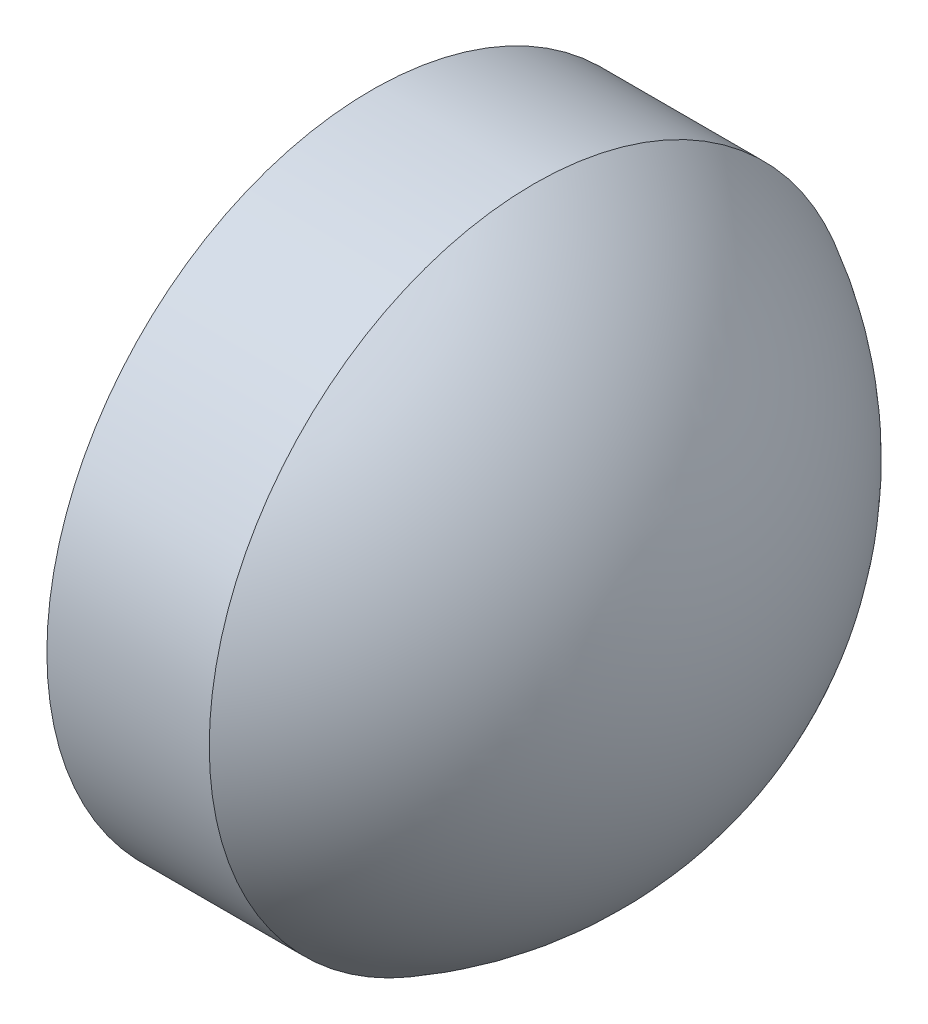
ISO-10303-21;
HEADER;
FILE_DESCRIPTION(('STEP AP214'),'2;1');
FILE_NAME('part.step','',(''),(''),'','','');
FILE_SCHEMA(('AUTOMOTIVE_DESIGN { 1 0 10303 214 1 1 1 1 }'));
ENDSEC;
DATA;
#1=APPLICATION_CONTEXT('core data for automotive mechanical design processes');
#2=APPLICATION_PROTOCOL_DEFINITION('international standard','automotive_design',2000,#1);
#3=PRODUCT_CONTEXT('',#1,'mechanical');
#4=PRODUCT('Part','Part','',(#3));
#5=PRODUCT_RELATED_PRODUCT_CATEGORY('part','',(#4));
#6=PRODUCT_DEFINITION_FORMATION('','',#4);
#7=PRODUCT_DEFINITION_CONTEXT('part definition',#1,'design');
#8=PRODUCT_DEFINITION('design','',#6,#7);
#9=PRODUCT_DEFINITION_SHAPE('','',#8);
#10=(LENGTH_UNIT() NAMED_UNIT(*) SI_UNIT(.MILLI.,.METRE.));
#11=(NAMED_UNIT(*) PLANE_ANGLE_UNIT() SI_UNIT($,.RADIAN.));
#12=(NAMED_UNIT(*) SI_UNIT($,.STERADIAN.) SOLID_ANGLE_UNIT());
#13=UNCERTAINTY_MEASURE_WITH_UNIT(LENGTH_MEASURE(1.E-05),#10,'distance_accuracy_value','');
#14=(GEOMETRIC_REPRESENTATION_CONTEXT(3) GLOBAL_UNCERTAINTY_ASSIGNED_CONTEXT((#13)) GLOBAL_UNIT_ASSIGNED_CONTEXT((#10,
#11,#12)) REPRESENTATION_CONTEXT('',''));
#15=CARTESIAN_POINT('',(0.,0.,0.));
#16=DIRECTION('',(0.,0.,1.));
#17=DIRECTION('',(1.,0.,0.));
#18=AXIS2_PLACEMENT_3D('',#15,#16,#17);
#19=CARTESIAN_POINT('',(360.225864803302,32.4014421281485,0.));
#20=DIRECTION('',(-1.,0.,0.));
#21=DIRECTION('',(0.,1.,0.));
#22=AXIS2_PLACEMENT_3D('',#19,#20,#21);
#23=SPHERICAL_SURFACE('',#22,2.26666666666669);
#24=CARTESIAN_POINT('',(361.292531469969,32.4014421281485,0.));
#25=DIRECTION('',(-1.,0.,0.));
#26=DIRECTION('',(0.,0.,1.));
#27=AXIS2_PLACEMENT_3D('',#24,#25,#26);
#28=CIRCLE('',#27,2.);
#29=CARTESIAN_POINT('',(361.292531469969,32.4014421281485,2.));
#30=VERTEX_POINT('',#29);
#31=EDGE_CURVE('E10',#30,#30,#28,.T.);
#32=ORIENTED_EDGE('',*,*,#31,.F.);
#33=EDGE_LOOP('',(#32));
#34=FACE_BOUND('',#33,.T.);
#35=ADVANCED_FACE('F35',(#34),#23,.T.);
#36=CARTESIAN_POINT('',(359.864424775922,32.4014421281485,0.));
#37=DIRECTION('',(-1.,0.,0.));
#38=DIRECTION('',(0.,0.,1.));
#39=AXIS2_PLACEMENT_3D('',#36,#37,#38);
#40=CYLINDRICAL_SURFACE('',#39,2.);
#41=CARTESIAN_POINT('',(360.292531469969,32.4014421281485,0.));
#42=DIRECTION('',(-1.,0.,0.));
#43=DIRECTION('',(0.,0.,1.));
#44=AXIS2_PLACEMENT_3D('',#41,#42,#43);
#45=CIRCLE('',#44,2.);
#46=CARTESIAN_POINT('',(360.292531469969,32.4014421281485,2.));
#47=VERTEX_POINT('',#46);
#48=EDGE_CURVE('E41',#47,#47,#45,.T.);
#49=ORIENTED_EDGE('',*,*,#48,.F.);
#50=EDGE_LOOP('',(#49));
#51=FACE_BOUND('',#50,.T.);
#52=ORIENTED_EDGE('',*,*,#31,.T.);
#53=EDGE_LOOP('',(#52));
#54=FACE_BOUND('',#53,.T.);
#55=ADVANCED_FACE('F49',(#51,#54),#40,.T.);
#56=CARTESIAN_POINT('',(360.292531469969,32.4014421281485,0.));
#57=DIRECTION('',(1.,0.,0.));
#58=DIRECTION('',(0.,0.,-1.));
#59=AXIS2_PLACEMENT_3D('',#56,#57,#58);
#60=PLANE('',#59);
#61=ORIENTED_EDGE('',*,*,#48,.T.);
#62=EDGE_LOOP('',(#61));
#63=FACE_BOUND('',#62,.T.);
#64=ADVANCED_FACE('F47',(#63),#60,.F.);
#65=CLOSED_SHELL('',(#35,#55,#64));
#66=MANIFOLD_SOLID_BREP('B2',#65);
#67=ADVANCED_BREP_SHAPE_REPRESENTATION('',(#18,#66),#14);
#68=SHAPE_DEFINITION_REPRESENTATION(#9,#67);
ENDSEC;
END-ISO-10303-21;
